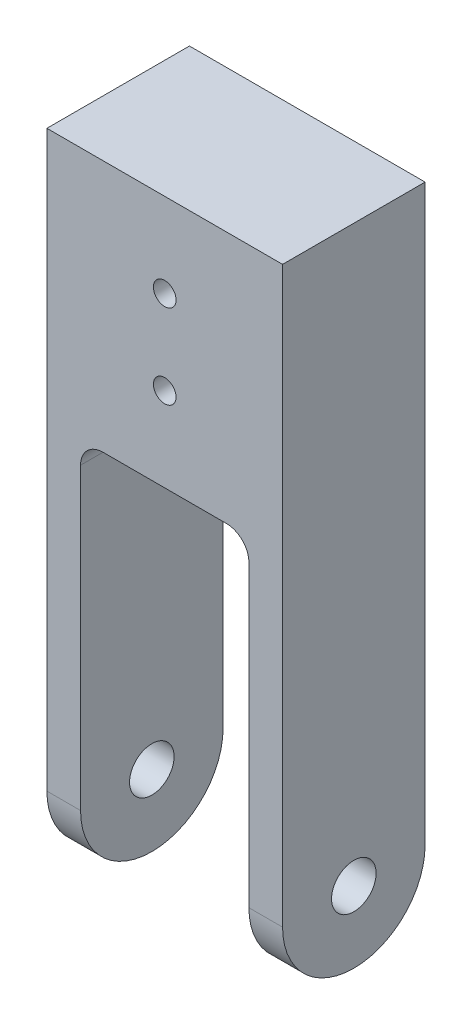
ISO-10303-21;
HEADER;
FILE_DESCRIPTION(('STEP AP214'),'2;1');
FILE_NAME('part.step','',(''),(''),'','','');
FILE_SCHEMA(('AUTOMOTIVE_DESIGN { 1 0 10303 214 1 1 1 1 }'));
ENDSEC;
DATA;
#1=APPLICATION_CONTEXT('core data for automotive mechanical design processes');
#2=APPLICATION_PROTOCOL_DEFINITION('international standard','automotive_design',2000,#1);
#3=PRODUCT_CONTEXT('',#1,'mechanical');
#4=PRODUCT('Part','Part','',(#3));
#5=PRODUCT_RELATED_PRODUCT_CATEGORY('part','',(#4));
#6=PRODUCT_DEFINITION_FORMATION('','',#4);
#7=PRODUCT_DEFINITION_CONTEXT('part definition',#1,'design');
#8=PRODUCT_DEFINITION('design','',#6,#7);
#9=PRODUCT_DEFINITION_SHAPE('','',#8);
#10=(LENGTH_UNIT() NAMED_UNIT(*) SI_UNIT(.MILLI.,.METRE.));
#11=(NAMED_UNIT(*) PLANE_ANGLE_UNIT() SI_UNIT($,.RADIAN.));
#12=(NAMED_UNIT(*) SI_UNIT($,.STERADIAN.) SOLID_ANGLE_UNIT());
#13=UNCERTAINTY_MEASURE_WITH_UNIT(LENGTH_MEASURE(1.E-05),#10,'distance_accuracy_value','');
#14=(GEOMETRIC_REPRESENTATION_CONTEXT(3) GLOBAL_UNCERTAINTY_ASSIGNED_CONTEXT((#13)) GLOBAL_UNIT_ASSIGNED_CONTEXT((#10,
#11,#12)) REPRESENTATION_CONTEXT('',''));
#15=CARTESIAN_POINT('',(0.,0.,0.));
#16=DIRECTION('',(0.,0.,1.));
#17=DIRECTION('',(1.,0.,0.));
#18=AXIS2_PLACEMENT_3D('',#15,#16,#17);
#19=CARTESIAN_POINT('',(21.,0.,-12.7));
#20=DIRECTION('',(0.,-1.,0.));
#21=DIRECTION('',(0.,0.,-1.));
#22=AXIS2_PLACEMENT_3D('',#19,#20,#21);
#23=PLANE('',#22);
#24=DIRECTION('',(-1.,0.,0.));
#25=VECTOR('',#24,1.);
#26=CARTESIAN_POINT('',(-21.,0.,-12.7));
#27=LINE('',#26,#25);
#28=CARTESIAN_POINT('',(11.,0.,-12.7));
#29=VERTEX_POINT('',#28);
#30=CARTESIAN_POINT('',(-11.,0.,-12.7));
#31=VERTEX_POINT('',#30);
#32=EDGE_CURVE('E177',#29,#31,#27,.T.);
#33=ORIENTED_EDGE('',*,*,#32,.F.);
#34=DIRECTION('',(0.,0.,-1.));
#35=VECTOR('',#34,1.);
#36=CARTESIAN_POINT('',(11.,0.,-12.7));
#37=LINE('',#36,#35);
#38=CARTESIAN_POINT('',(11.,0.,12.7));
#39=VERTEX_POINT('',#38);
#40=EDGE_CURVE('E237',#29,#39,#37,.F.);
#41=ORIENTED_EDGE('',*,*,#40,.T.);
#42=DIRECTION('',(1.,0.,0.));
#43=VECTOR('',#42,1.);
#44=CARTESIAN_POINT('',(-21.,0.,12.7));
#45=LINE('',#44,#43);
#46=CARTESIAN_POINT('',(-11.,0.,12.7));
#47=VERTEX_POINT('',#46);
#48=EDGE_CURVE('E232',#47,#39,#45,.T.);
#49=ORIENTED_EDGE('',*,*,#48,.F.);
#50=DIRECTION('',(0.,0.,1.));
#51=VECTOR('',#50,1.);
#52=CARTESIAN_POINT('',(-11.,0.,-12.7));
#53=LINE('',#52,#51);
#54=EDGE_CURVE('E235',#47,#31,#53,.F.);
#55=ORIENTED_EDGE('',*,*,#54,.T.);
#56=EDGE_LOOP('',(#33,#41,#49,#55));
#57=FACE_BOUND('',#56,.T.);
#58=ADVANCED_FACE('F36',(#57),#23,.T.);
#59=CARTESIAN_POINT('',(21.,70.,12.7));
#60=DIRECTION('',(-1.,0.,0.));
#61=DIRECTION('',(0.,0.,1.));
#62=AXIS2_PLACEMENT_3D('',#59,#60,#61);
#63=PLANE('',#62);
#64=CARTESIAN_POINT('',(21.,-57.3,0.));
#65=DIRECTION('',(-1.,0.,0.));
#66=DIRECTION('',(0.,0.,1.));
#67=AXIS2_PLACEMENT_3D('',#64,#65,#66);
#68=CIRCLE('',#67,3.96875);
#69=CARTESIAN_POINT('',(21.,-57.3,3.96875));
#70=VERTEX_POINT('',#69);
#71=EDGE_CURVE('E213',#70,#70,#68,.T.);
#72=ORIENTED_EDGE('',*,*,#71,.T.);
#73=EDGE_LOOP('',(#72));
#74=FACE_BOUND('',#73,.T.);
#75=DIRECTION('',(0.,-1.,0.));
#76=VECTOR('',#75,1.);
#77=CARTESIAN_POINT('',(21.,70.,-12.7));
#78=LINE('',#77,#76);
#79=CARTESIAN_POINT('',(21.,44.9999999999998,-12.7));
#80=VERTEX_POINT('',#79);
#81=CARTESIAN_POINT('',(21.,-57.3,-12.7));
#82=VERTEX_POINT('',#81);
#83=EDGE_CURVE('E145',#80,#82,#78,.T.);
#84=ORIENTED_EDGE('',*,*,#83,.F.);
#85=DIRECTION('',(0.,0.,1.));
#86=VECTOR('',#85,1.);
#87=CARTESIAN_POINT('',(21.,44.9999999999998,-12.7));
#88=LINE('',#87,#86);
#89=CARTESIAN_POINT('',(21.,44.9999999999998,12.7));
#90=VERTEX_POINT('',#89);
#91=EDGE_CURVE('E126',#80,#90,#88,.T.);
#92=ORIENTED_EDGE('',*,*,#91,.T.);
#93=DIRECTION('',(0.,-1.,0.));
#94=VECTOR('',#93,1.);
#95=CARTESIAN_POINT('',(21.,70.,12.7));
#96=LINE('',#95,#94);
#97=CARTESIAN_POINT('',(21.,-57.3,12.7));
#98=VERTEX_POINT('',#97);
#99=EDGE_CURVE('E149',#90,#98,#96,.T.);
#100=ORIENTED_EDGE('',*,*,#99,.T.);
#101=CARTESIAN_POINT('',(21.,-57.3,0.));
#102=DIRECTION('',(-1.,0.,0.));
#103=DIRECTION('',(0.,0.,1.));
#104=AXIS2_PLACEMENT_3D('',#101,#102,#103);
#105=CIRCLE('',#104,12.7);
#106=CARTESIAN_POINT('',(21.,-70.,0.));
#107=VERTEX_POINT('',#106);
#108=EDGE_CURVE('E174',#98,#107,#105,.F.);
#109=ORIENTED_EDGE('',*,*,#108,.T.);
#110=CARTESIAN_POINT('',(21.,-57.3,0.));
#111=DIRECTION('',(-1.,0.,0.));
#112=DIRECTION('',(0.,0.,1.));
#113=AXIS2_PLACEMENT_3D('',#110,#111,#112);
#114=CIRCLE('',#113,12.7);
#115=EDGE_CURVE('E171',#107,#82,#114,.F.);
#116=ORIENTED_EDGE('',*,*,#115,.T.);
#117=EDGE_LOOP('',(#84,#92,#100,#109,#116));
#118=FACE_BOUND('',#117,.T.);
#119=ADVANCED_FACE('F265',(#74,#118),#63,.F.);
#120=CARTESIAN_POINT('',(-21.,70.,-12.7));
#121=DIRECTION('',(0.,0.,1.));
#122=DIRECTION('',(1.,0.,0.));
#123=AXIS2_PLACEMENT_3D('',#120,#121,#122);
#124=PLANE('',#123);
#125=CARTESIAN_POINT('',(0.,30.,-12.7));
#126=DIRECTION('',(0.,0.,1.));
#127=DIRECTION('',(1.,0.,0.));
#128=AXIS2_PLACEMENT_3D('',#125,#126,#127);
#129=CIRCLE('',#128,2.01929999999999);
#130=CARTESIAN_POINT('',(2.0193,30.,-12.7));
#131=VERTEX_POINT('',#130);
#132=EDGE_CURVE('E193',#131,#131,#129,.T.);
#133=ORIENTED_EDGE('',*,*,#132,.T.);
#134=EDGE_LOOP('',(#133));
#135=FACE_BOUND('',#134,.T.);
#136=CARTESIAN_POINT('',(0.,15.,-12.7));
#137=DIRECTION('',(0.,0.,1.));
#138=DIRECTION('',(1.,0.,0.));
#139=AXIS2_PLACEMENT_3D('',#136,#137,#138);
#140=CIRCLE('',#139,2.01929999999999);
#141=CARTESIAN_POINT('',(2.0193,15.,-12.7));
#142=VERTEX_POINT('',#141);
#143=EDGE_CURVE('E209',#142,#142,#140,.T.);
#144=ORIENTED_EDGE('',*,*,#143,.T.);
#145=EDGE_LOOP('',(#144));
#146=FACE_BOUND('',#145,.T.);
#147=DIRECTION('',(0.,-1.,0.));
#148=VECTOR('',#147,1.);
#149=CARTESIAN_POINT('',(-21.,70.,-12.7));
#150=LINE('',#149,#148);
#151=CARTESIAN_POINT('',(-21.,44.9999999999998,-12.7));
#152=VERTEX_POINT('',#151);
#153=CARTESIAN_POINT('',(-21.,-57.3,-12.7));
#154=VERTEX_POINT('',#153);
#155=EDGE_CURVE('E135',#152,#154,#150,.T.);
#156=ORIENTED_EDGE('',*,*,#155,.F.);
#157=DIRECTION('',(1.,0.,0.));
#158=VECTOR('',#157,1.);
#159=CARTESIAN_POINT('',(-21.,44.9999999999998,-12.7));
#160=LINE('',#159,#158);
#161=EDGE_CURVE('E123',#152,#80,#160,.T.);
#162=ORIENTED_EDGE('',*,*,#161,.T.);
#163=ORIENTED_EDGE('',*,*,#83,.T.);
#164=DIRECTION('',(1.,0.,0.));
#165=VECTOR('',#164,1.);
#166=CARTESIAN_POINT('',(-21.,-57.3,-12.7));
#167=LINE('',#166,#165);
#168=CARTESIAN_POINT('',(15.,-57.3,-12.7));
#169=VERTEX_POINT('',#168);
#170=EDGE_CURVE('E179',#82,#169,#167,.F.);
#171=ORIENTED_EDGE('',*,*,#170,.T.);
#172=DIRECTION('',(0.,1.,0.));
#173=VECTOR('',#172,1.);
#174=CARTESIAN_POINT('',(15.,-70.,-12.7));
#175=LINE('',#174,#173);
#176=CARTESIAN_POINT('',(15.,-4.,-12.7));
#177=VERTEX_POINT('',#176);
#178=EDGE_CURVE('E222',#169,#177,#175,.T.);
#179=ORIENTED_EDGE('',*,*,#178,.T.);
#180=CARTESIAN_POINT('',(11.,-4.,-12.7));
#181=DIRECTION('',(0.,0.,1.));
#182=DIRECTION('',(1.,0.,0.));
#183=AXIS2_PLACEMENT_3D('',#180,#181,#182);
#184=CIRCLE('',#183,4.);
#185=EDGE_CURVE('E242',#177,#29,#184,.T.);
#186=ORIENTED_EDGE('',*,*,#185,.T.);
#187=ORIENTED_EDGE('',*,*,#32,.T.);
#188=CARTESIAN_POINT('',(-11.,-4.,-12.7));
#189=DIRECTION('',(0.,0.,1.));
#190=DIRECTION('',(1.,0.,0.));
#191=AXIS2_PLACEMENT_3D('',#188,#189,#190);
#192=CIRCLE('',#191,4.);
#193=CARTESIAN_POINT('',(-15.,-4.,-12.7));
#194=VERTEX_POINT('',#193);
#195=EDGE_CURVE('E249',#31,#194,#192,.T.);
#196=ORIENTED_EDGE('',*,*,#195,.T.);
#197=DIRECTION('',(0.,1.,0.));
#198=VECTOR('',#197,1.);
#199=CARTESIAN_POINT('',(-15.,-70.,-12.7));
#200=LINE('',#199,#198);
#201=CARTESIAN_POINT('',(-15.,-57.3,-12.7));
#202=VERTEX_POINT('',#201);
#203=EDGE_CURVE('E161',#202,#194,#200,.T.);
#204=ORIENTED_EDGE('',*,*,#203,.F.);
#205=DIRECTION('',(1.,0.,0.));
#206=VECTOR('',#205,1.);
#207=CARTESIAN_POINT('',(-21.,-57.3,-12.7));
#208=LINE('',#207,#206);
#209=EDGE_CURVE('E143',#202,#154,#208,.F.);
#210=ORIENTED_EDGE('',*,*,#209,.T.);
#211=EDGE_LOOP('',(#156,#162,#163,#171,#179,#186,#187,#196,#204,#210));
#212=FACE_BOUND('',#211,.T.);
#213=ADVANCED_FACE('F140',(#135,#146,#212),#124,.F.);
#214=CARTESIAN_POINT('',(-21.,70.,12.7));
#215=DIRECTION('',(1.,0.,0.));
#216=DIRECTION('',(0.,0.,-1.));
#217=AXIS2_PLACEMENT_3D('',#214,#215,#216);
#218=PLANE('',#217);
#219=CARTESIAN_POINT('',(-21.,-57.3,0.));
#220=DIRECTION('',(-1.,0.,0.));
#221=DIRECTION('',(0.,0.,1.));
#222=AXIS2_PLACEMENT_3D('',#219,#220,#221);
#223=CIRCLE('',#222,3.96875);
#224=CARTESIAN_POINT('',(-21.,-57.3,3.96875));
#225=VERTEX_POINT('',#224);
#226=EDGE_CURVE('E212',#225,#225,#223,.T.);
#227=ORIENTED_EDGE('',*,*,#226,.F.);
#228=EDGE_LOOP('',(#227));
#229=FACE_BOUND('',#228,.T.);
#230=DIRECTION('',(0.,-1.,0.));
#231=VECTOR('',#230,1.);
#232=CARTESIAN_POINT('',(-21.,70.,12.7));
#233=LINE('',#232,#231);
#234=CARTESIAN_POINT('',(-21.,44.9999999999998,12.7));
#235=VERTEX_POINT('',#234);
#236=CARTESIAN_POINT('',(-21.,-57.3,12.7));
#237=VERTEX_POINT('',#236);
#238=EDGE_CURVE('E138',#235,#237,#233,.T.);
#239=ORIENTED_EDGE('',*,*,#238,.F.);
#240=DIRECTION('',(0.,0.,1.));
#241=VECTOR('',#240,1.);
#242=CARTESIAN_POINT('',(-21.,44.9999999999998,-12.7));
#243=LINE('',#242,#241);
#244=EDGE_CURVE('E53',#152,#235,#243,.T.);
#245=ORIENTED_EDGE('',*,*,#244,.F.);
#246=ORIENTED_EDGE('',*,*,#155,.T.);
#247=CARTESIAN_POINT('',(-21.,-57.3,0.));
#248=DIRECTION('',(1.,0.,0.));
#249=DIRECTION('',(0.,0.,-1.));
#250=AXIS2_PLACEMENT_3D('',#247,#248,#249);
#251=CIRCLE('',#250,12.7);
#252=CARTESIAN_POINT('',(-21.,-70.,0.));
#253=VERTEX_POINT('',#252);
#254=EDGE_CURVE('E181',#154,#253,#251,.F.);
#255=ORIENTED_EDGE('',*,*,#254,.T.);
#256=CARTESIAN_POINT('',(-21.,-57.3,0.));
#257=DIRECTION('',(1.,0.,0.));
#258=DIRECTION('',(0.,0.,-1.));
#259=AXIS2_PLACEMENT_3D('',#256,#257,#258);
#260=CIRCLE('',#259,12.7);
#261=EDGE_CURVE('E183',#253,#237,#260,.F.);
#262=ORIENTED_EDGE('',*,*,#261,.T.);
#263=EDGE_LOOP('',(#239,#245,#246,#255,#262));
#264=FACE_BOUND('',#263,.T.);
#265=ADVANCED_FACE('F134',(#229,#264),#218,.F.);
#266=CARTESIAN_POINT('',(-21.,70.,12.7));
#267=DIRECTION('',(0.,0.,-1.));
#268=DIRECTION('',(-1.,0.,0.));
#269=AXIS2_PLACEMENT_3D('',#266,#267,#268);
#270=PLANE('',#269);
#271=CARTESIAN_POINT('',(0.,30.,12.7));
#272=DIRECTION('',(0.,0.,1.));
#273=DIRECTION('',(1.,0.,0.));
#274=AXIS2_PLACEMENT_3D('',#271,#272,#273);
#275=CIRCLE('',#274,2.01929999999999);
#276=CARTESIAN_POINT('',(2.01929999999999,30.,12.7));
#277=VERTEX_POINT('',#276);
#278=EDGE_CURVE('E187',#277,#277,#275,.T.);
#279=ORIENTED_EDGE('',*,*,#278,.F.);
#280=EDGE_LOOP('',(#279));
#281=FACE_BOUND('',#280,.T.);
#282=CARTESIAN_POINT('',(0.,15.,12.7));
#283=DIRECTION('',(0.,0.,1.));
#284=DIRECTION('',(1.,0.,0.));
#285=AXIS2_PLACEMENT_3D('',#282,#283,#284);
#286=CIRCLE('',#285,2.01929999999999);
#287=CARTESIAN_POINT('',(2.01929999999999,15.,12.7));
#288=VERTEX_POINT('',#287);
#289=EDGE_CURVE('E206',#288,#288,#286,.T.);
#290=ORIENTED_EDGE('',*,*,#289,.F.);
#291=EDGE_LOOP('',(#290));
#292=FACE_BOUND('',#291,.T.);
#293=ORIENTED_EDGE('',*,*,#99,.F.);
#294=DIRECTION('',(1.,0.,0.));
#295=VECTOR('',#294,1.);
#296=CARTESIAN_POINT('',(-21.,44.9999999999998,12.7));
#297=LINE('',#296,#295);
#298=EDGE_CURVE('E130',#235,#90,#297,.T.);
#299=ORIENTED_EDGE('',*,*,#298,.F.);
#300=ORIENTED_EDGE('',*,*,#238,.T.);
#301=DIRECTION('',(-1.,0.,0.));
#302=VECTOR('',#301,1.);
#303=CARTESIAN_POINT('',(-15.,-57.3,12.7));
#304=LINE('',#303,#302);
#305=CARTESIAN_POINT('',(-15.,-57.3,12.7));
#306=VERTEX_POINT('',#305);
#307=EDGE_CURVE('E165',#237,#306,#304,.F.);
#308=ORIENTED_EDGE('',*,*,#307,.T.);
#309=DIRECTION('',(0.,1.,0.));
#310=VECTOR('',#309,1.);
#311=CARTESIAN_POINT('',(-15.,-70.,12.7));
#312=LINE('',#311,#310);
#313=CARTESIAN_POINT('',(-15.,-4.,12.7));
#314=VERTEX_POINT('',#313);
#315=EDGE_CURVE('E158',#306,#314,#312,.T.);
#316=ORIENTED_EDGE('',*,*,#315,.T.);
#317=CARTESIAN_POINT('',(-11.,-4.,12.7));
#318=DIRECTION('',(0.,0.,-1.));
#319=DIRECTION('',(-1.,0.,0.));
#320=AXIS2_PLACEMENT_3D('',#317,#318,#319);
#321=CIRCLE('',#320,4.);
#322=EDGE_CURVE('E247',#314,#47,#321,.T.);
#323=ORIENTED_EDGE('',*,*,#322,.T.);
#324=ORIENTED_EDGE('',*,*,#48,.T.);
#325=CARTESIAN_POINT('',(11.,-4.,12.7));
#326=DIRECTION('',(0.,0.,-1.));
#327=DIRECTION('',(-1.,0.,0.));
#328=AXIS2_PLACEMENT_3D('',#325,#326,#327);
#329=CIRCLE('',#328,4.);
#330=CARTESIAN_POINT('',(15.,-4.,12.7));
#331=VERTEX_POINT('',#330);
#332=EDGE_CURVE('E244',#39,#331,#329,.T.);
#333=ORIENTED_EDGE('',*,*,#332,.T.);
#334=DIRECTION('',(0.,1.,0.));
#335=VECTOR('',#334,1.);
#336=CARTESIAN_POINT('',(15.,-70.,12.7));
#337=LINE('',#336,#335);
#338=CARTESIAN_POINT('',(15.,-57.3,12.7));
#339=VERTEX_POINT('',#338);
#340=EDGE_CURVE('E162',#339,#331,#337,.T.);
#341=ORIENTED_EDGE('',*,*,#340,.F.);
#342=DIRECTION('',(-1.,0.,0.));
#343=VECTOR('',#342,1.);
#344=CARTESIAN_POINT('',(-21.,-57.3,12.7));
#345=LINE('',#344,#343);
#346=EDGE_CURVE('E168',#339,#98,#345,.F.);
#347=ORIENTED_EDGE('',*,*,#346,.T.);
#348=EDGE_LOOP('',(#293,#299,#300,#308,#316,#323,#324,#333,#341,#347));
#349=FACE_BOUND('',#348,.T.);
#350=ADVANCED_FACE('F260',(#281,#292,#349),#270,.F.);
#351=CARTESIAN_POINT('',(-15.,-70.,12.7));
#352=DIRECTION('',(-1.,0.,0.));
#353=DIRECTION('',(0.,0.,1.));
#354=AXIS2_PLACEMENT_3D('',#351,#352,#353);
#355=PLANE('',#354);
#356=CARTESIAN_POINT('',(-15.,-57.3,0.));
#357=DIRECTION('',(-1.,0.,0.));
#358=DIRECTION('',(0.,0.,1.));
#359=AXIS2_PLACEMENT_3D('',#356,#357,#358);
#360=CIRCLE('',#359,3.96875);
#361=CARTESIAN_POINT('',(-15.,-57.3,3.96875));
#362=VERTEX_POINT('',#361);
#363=EDGE_CURVE('E219',#362,#362,#360,.T.);
#364=ORIENTED_EDGE('',*,*,#363,.T.);
#365=EDGE_LOOP('',(#364));
#366=FACE_BOUND('',#365,.T.);
#367=ORIENTED_EDGE('',*,*,#315,.F.);
#368=CARTESIAN_POINT('',(-15.,-57.3,0.));
#369=DIRECTION('',(-1.,0.,0.));
#370=DIRECTION('',(0.,0.,1.));
#371=AXIS2_PLACEMENT_3D('',#368,#369,#370);
#372=CIRCLE('',#371,12.7);
#373=CARTESIAN_POINT('',(-15.,-70.,0.));
#374=VERTEX_POINT('',#373);
#375=EDGE_CURVE('E11',#306,#374,#372,.F.);
#376=ORIENTED_EDGE('',*,*,#375,.T.);
#377=CARTESIAN_POINT('',(-15.,-57.3,0.));
#378=DIRECTION('',(-1.,0.,0.));
#379=DIRECTION('',(0.,0.,1.));
#380=AXIS2_PLACEMENT_3D('',#377,#378,#379);
#381=CIRCLE('',#380,12.7);
#382=EDGE_CURVE('E45',#374,#202,#381,.F.);
#383=ORIENTED_EDGE('',*,*,#382,.T.);
#384=ORIENTED_EDGE('',*,*,#203,.T.);
#385=DIRECTION('',(0.,0.,1.));
#386=VECTOR('',#385,1.);
#387=CARTESIAN_POINT('',(-15.,-4.,12.7));
#388=LINE('',#387,#386);
#389=EDGE_CURVE('E239',#194,#314,#388,.T.);
#390=ORIENTED_EDGE('',*,*,#389,.T.);
#391=EDGE_LOOP('',(#367,#376,#383,#384,#390));
#392=FACE_BOUND('',#391,.T.);
#393=ADVANCED_FACE('F285',(#366,#392),#355,.F.);
#394=CARTESIAN_POINT('',(15.,-70.,12.7));
#395=DIRECTION('',(1.,0.,0.));
#396=DIRECTION('',(0.,0.,-1.));
#397=AXIS2_PLACEMENT_3D('',#394,#395,#396);
#398=PLANE('',#397);
#399=CARTESIAN_POINT('',(15.,-57.3,0.));
#400=DIRECTION('',(1.,0.,0.));
#401=DIRECTION('',(0.,0.,-1.));
#402=AXIS2_PLACEMENT_3D('',#399,#400,#401);
#403=CIRCLE('',#402,3.96875);
#404=CARTESIAN_POINT('',(15.,-57.3,3.96875));
#405=VERTEX_POINT('',#404);
#406=EDGE_CURVE('E216',#405,#405,#403,.T.);
#407=ORIENTED_EDGE('',*,*,#406,.T.);
#408=EDGE_LOOP('',(#407));
#409=FACE_BOUND('',#408,.T.);
#410=CARTESIAN_POINT('',(15.,-57.3,0.));
#411=DIRECTION('',(1.,0.,0.));
#412=DIRECTION('',(0.,0.,-1.));
#413=AXIS2_PLACEMENT_3D('',#410,#411,#412);
#414=CIRCLE('',#413,12.7);
#415=CARTESIAN_POINT('',(15.,-70.,0.));
#416=VERTEX_POINT('',#415);
#417=EDGE_CURVE('E251',#169,#416,#414,.F.);
#418=ORIENTED_EDGE('',*,*,#417,.T.);
#419=CARTESIAN_POINT('',(15.,-57.3,0.));
#420=DIRECTION('',(1.,0.,0.));
#421=DIRECTION('',(0.,0.,-1.));
#422=AXIS2_PLACEMENT_3D('',#419,#420,#421);
#423=CIRCLE('',#422,12.7);
#424=EDGE_CURVE('E163',#416,#339,#423,.F.);
#425=ORIENTED_EDGE('',*,*,#424,.T.);
#426=ORIENTED_EDGE('',*,*,#340,.T.);
#427=DIRECTION('',(0.,0.,-1.));
#428=VECTOR('',#427,1.);
#429=CARTESIAN_POINT('',(15.,-4.,12.7));
#430=LINE('',#429,#428);
#431=EDGE_CURVE('E147',#331,#177,#430,.T.);
#432=ORIENTED_EDGE('',*,*,#431,.T.);
#433=ORIENTED_EDGE('',*,*,#178,.F.);
#434=EDGE_LOOP('',(#418,#425,#426,#432,#433));
#435=FACE_BOUND('',#434,.T.);
#436=ADVANCED_FACE('F256',(#409,#435),#398,.F.);
#437=CARTESIAN_POINT('',(21.,-57.3,0.));
#438=DIRECTION('',(-1.,0.,0.));
#439=DIRECTION('',(0.,0.,1.));
#440=AXIS2_PLACEMENT_3D('',#437,#438,#439);
#441=CYLINDRICAL_SURFACE('',#440,3.96875);
#442=CARTESIAN_POINT('',(21.,-57.3,3.96875));
#443=CARTESIAN_POINT('',(20.9375,-57.3,3.96875));
#444=CARTESIAN_POINT('',(20.875,-57.3,3.96875));
#445=CARTESIAN_POINT('',(20.75,-57.3,3.96875));
#446=CARTESIAN_POINT('',(20.6875,-57.3,3.96875));
#447=CARTESIAN_POINT('',(20.5625,-57.3,3.96875));
#448=CARTESIAN_POINT('',(20.5,-57.3,3.96875));
#449=CARTESIAN_POINT('',(20.375,-57.3,3.96875));
#450=CARTESIAN_POINT('',(20.3125,-57.3,3.96875));
#451=CARTESIAN_POINT('',(20.1875,-57.3,3.96875));
#452=CARTESIAN_POINT('',(20.125,-57.3,3.96875));
#453=CARTESIAN_POINT('',(20.,-57.3,3.96875));
#454=CARTESIAN_POINT('',(19.9375,-57.3,3.96875));
#455=CARTESIAN_POINT('',(19.8125,-57.3,3.96875));
#456=CARTESIAN_POINT('',(19.75,-57.3,3.96875));
#457=CARTESIAN_POINT('',(19.625,-57.3,3.96875));
#458=CARTESIAN_POINT('',(19.5625,-57.3,3.96875));
#459=CARTESIAN_POINT('',(19.4375,-57.3,3.96875));
#460=CARTESIAN_POINT('',(19.375,-57.3,3.96875));
#461=CARTESIAN_POINT('',(19.25,-57.3,3.96875));
#462=CARTESIAN_POINT('',(19.1875,-57.3,3.96875));
#463=CARTESIAN_POINT('',(19.0625,-57.3,3.96875));
#464=CARTESIAN_POINT('',(19.,-57.3,3.96875));
#465=CARTESIAN_POINT('',(18.875,-57.3,3.96875));
#466=CARTESIAN_POINT('',(18.8125,-57.3,3.96875));
#467=CARTESIAN_POINT('',(18.6875,-57.3,3.96875));
#468=CARTESIAN_POINT('',(18.625,-57.3,3.96875));
#469=CARTESIAN_POINT('',(18.5,-57.3,3.96875));
#470=CARTESIAN_POINT('',(18.4375,-57.3,3.96875));
#471=CARTESIAN_POINT('',(18.3125,-57.3,3.96875));
#472=CARTESIAN_POINT('',(18.25,-57.3,3.96875));
#473=CARTESIAN_POINT('',(18.125,-57.3,3.96875));
#474=CARTESIAN_POINT('',(18.0625,-57.3,3.96875));
#475=CARTESIAN_POINT('',(17.9375,-57.3,3.96875));
#476=CARTESIAN_POINT('',(17.875,-57.3,3.96875));
#477=CARTESIAN_POINT('',(17.75,-57.3,3.96875));
#478=CARTESIAN_POINT('',(17.6875,-57.3,3.96875));
#479=CARTESIAN_POINT('',(17.5625,-57.3,3.96875));
#480=CARTESIAN_POINT('',(17.5,-57.3,3.96875));
#481=CARTESIAN_POINT('',(17.375,-57.3,3.96875));
#482=CARTESIAN_POINT('',(17.3125,-57.3,3.96875));
#483=CARTESIAN_POINT('',(17.1875,-57.3,3.96875));
#484=CARTESIAN_POINT('',(17.125,-57.3,3.96875));
#485=CARTESIAN_POINT('',(17.,-57.3,3.96875));
#486=CARTESIAN_POINT('',(16.9375,-57.3,3.96875));
#487=CARTESIAN_POINT('',(16.8125,-57.3,3.96875));
#488=CARTESIAN_POINT('',(16.75,-57.3,3.96875));
#489=CARTESIAN_POINT('',(16.625,-57.3,3.96875));
#490=CARTESIAN_POINT('',(16.5625,-57.3,3.96875));
#491=CARTESIAN_POINT('',(16.4375,-57.3,3.96875));
#492=CARTESIAN_POINT('',(16.375,-57.3,3.96875));
#493=CARTESIAN_POINT('',(16.25,-57.3,3.96875));
#494=CARTESIAN_POINT('',(16.1875,-57.3,3.96875));
#495=CARTESIAN_POINT('',(16.0625,-57.3,3.96875));
#496=CARTESIAN_POINT('',(16.,-57.3,3.96875));
#497=CARTESIAN_POINT('',(15.875,-57.3,3.96875));
#498=CARTESIAN_POINT('',(15.8125,-57.3,3.96875));
#499=CARTESIAN_POINT('',(15.6875,-57.3,3.96875));
#500=CARTESIAN_POINT('',(15.625,-57.3,3.96875));
#501=CARTESIAN_POINT('',(15.5,-57.3,3.96875));
#502=CARTESIAN_POINT('',(15.4375,-57.3,3.96875));
#503=CARTESIAN_POINT('',(15.3125,-57.3,3.96875));
#504=CARTESIAN_POINT('',(15.25,-57.3,3.96875));
#505=CARTESIAN_POINT('',(15.125,-57.3,3.96875));
#506=CARTESIAN_POINT('',(15.0625,-57.3,3.96875));
#507=CARTESIAN_POINT('',(15.,-57.3,3.96875));
#508=B_SPLINE_CURVE_WITH_KNOTS('',3,(#442,#443,#444,#445,#446,#447,#448,#449,#450,#451,#452,
#453,#454,#455,#456,#457,#458,#459,#460,#461,#462,#463,#464,#465,#466,#467,#468,#469,#470,#471,
#472,#473,#474,#475,#476,#477,#478,#479,#480,#481,#482,#483,#484,#485,#486,#487,#488,#489,#490,
#491,#492,#493,#494,#495,#496,#497,#498,#499,#500,#501,#502,#503,#504,#505,#506,#507),
.UNSPECIFIED.,.F.,.F.,(4,2,2,2,2,2,2,2,2,2,2,2,2,2,2,2,2,2,2,2,2,2,2,2,2,2,2,2,2,2,2,2,4),(0.,
0.1875,0.375,0.5625,0.750000000000001,0.937500000000001,1.125,1.3125,1.5,1.6875,1.875,2.0625,
2.25,2.4375,2.625,2.8125,3.,3.1875,3.375,3.5625,3.75,3.9375,4.125,4.3125,4.5,4.6875,4.875,
5.0625,5.25,5.4375,5.62500000000001,5.81250000000001,6.00000000000001),.UNSPECIFIED.);
#509=EDGE_CURVE('BSEAM293',#70,#405,#508,.T.);
#510=ORIENTED_EDGE('',*,*,#71,.F.);
#511=ORIENTED_EDGE('',*,*,#406,.F.);
#512=ORIENTED_EDGE('',*,*,#509,.T.);
#513=ORIENTED_EDGE('',*,*,#509,.F.);
#514=EDGE_LOOP('',(#510,#512,#511,#513));
#515=FACE_BOUND('',#514,.T.);
#516=ADVANCED_FACE('F293',(#515),#441,.F.);
#517=CARTESIAN_POINT('',(-21.,-57.3,3.96875));
#518=CARTESIAN_POINT('',(-20.9375,-57.3,3.96875));
#519=CARTESIAN_POINT('',(-20.875,-57.3,3.96875));
#520=CARTESIAN_POINT('',(-20.75,-57.3,3.96875));
#521=CARTESIAN_POINT('',(-20.6875,-57.3,3.96875));
#522=CARTESIAN_POINT('',(-20.5625,-57.3,3.96875));
#523=CARTESIAN_POINT('',(-20.5,-57.3,3.96875));
#524=CARTESIAN_POINT('',(-20.375,-57.3,3.96875));
#525=CARTESIAN_POINT('',(-20.3125,-57.3,3.96875));
#526=CARTESIAN_POINT('',(-20.1875,-57.3,3.96875));
#527=CARTESIAN_POINT('',(-20.125,-57.3,3.96875));
#528=CARTESIAN_POINT('',(-20.,-57.3,3.96875));
#529=CARTESIAN_POINT('',(-19.9375,-57.3,3.96875));
#530=CARTESIAN_POINT('',(-19.8125,-57.3,3.96875));
#531=CARTESIAN_POINT('',(-19.75,-57.3,3.96875));
#532=CARTESIAN_POINT('',(-19.625,-57.3,3.96875));
#533=CARTESIAN_POINT('',(-19.5625,-57.3,3.96875));
#534=CARTESIAN_POINT('',(-19.4375,-57.3,3.96875));
#535=CARTESIAN_POINT('',(-19.375,-57.3,3.96875));
#536=CARTESIAN_POINT('',(-19.25,-57.3,3.96875));
#537=CARTESIAN_POINT('',(-19.1875,-57.3,3.96875));
#538=CARTESIAN_POINT('',(-19.0625,-57.3,3.96875));
#539=CARTESIAN_POINT('',(-19.,-57.3,3.96875));
#540=CARTESIAN_POINT('',(-18.875,-57.3,3.96875));
#541=CARTESIAN_POINT('',(-18.8125,-57.3,3.96875));
#542=CARTESIAN_POINT('',(-18.6875,-57.3,3.96875));
#543=CARTESIAN_POINT('',(-18.625,-57.3,3.96875));
#544=CARTESIAN_POINT('',(-18.5,-57.3,3.96875));
#545=CARTESIAN_POINT('',(-18.4375,-57.3,3.96875));
#546=CARTESIAN_POINT('',(-18.3125,-57.3,3.96875));
#547=CARTESIAN_POINT('',(-18.25,-57.3,3.96875));
#548=CARTESIAN_POINT('',(-18.125,-57.3,3.96875));
#549=CARTESIAN_POINT('',(-18.0625,-57.3,3.96875));
#550=CARTESIAN_POINT('',(-17.9375,-57.3,3.96875));
#551=CARTESIAN_POINT('',(-17.875,-57.3,3.96875));
#552=CARTESIAN_POINT('',(-17.75,-57.3,3.96875));
#553=CARTESIAN_POINT('',(-17.6875,-57.3,3.96875));
#554=CARTESIAN_POINT('',(-17.5625,-57.3,3.96875));
#555=CARTESIAN_POINT('',(-17.5,-57.3,3.96875));
#556=CARTESIAN_POINT('',(-17.375,-57.3,3.96875));
#557=CARTESIAN_POINT('',(-17.3125,-57.3,3.96875));
#558=CARTESIAN_POINT('',(-17.1875,-57.3,3.96875));
#559=CARTESIAN_POINT('',(-17.125,-57.3,3.96875));
#560=CARTESIAN_POINT('',(-17.,-57.3,3.96875));
#561=CARTESIAN_POINT('',(-16.9375,-57.3,3.96875));
#562=CARTESIAN_POINT('',(-16.8125,-57.3,3.96875));
#563=CARTESIAN_POINT('',(-16.75,-57.3,3.96875));
#564=CARTESIAN_POINT('',(-16.625,-57.3,3.96875));
#565=CARTESIAN_POINT('',(-16.5625,-57.3,3.96875));
#566=CARTESIAN_POINT('',(-16.4375,-57.3,3.96875));
#567=CARTESIAN_POINT('',(-16.375,-57.3,3.96875));
#568=CARTESIAN_POINT('',(-16.25,-57.3,3.96875));
#569=CARTESIAN_POINT('',(-16.1875,-57.3,3.96875));
#570=CARTESIAN_POINT('',(-16.0625,-57.3,3.96875));
#571=CARTESIAN_POINT('',(-16.,-57.3,3.96875));
#572=CARTESIAN_POINT('',(-15.875,-57.3,3.96875));
#573=CARTESIAN_POINT('',(-15.8125,-57.3,3.96875));
#574=CARTESIAN_POINT('',(-15.6875,-57.3,3.96875));
#575=CARTESIAN_POINT('',(-15.625,-57.3,3.96875));
#576=CARTESIAN_POINT('',(-15.5,-57.3,3.96875));
#577=CARTESIAN_POINT('',(-15.4375,-57.3,3.96875));
#578=CARTESIAN_POINT('',(-15.3125,-57.3,3.96875));
#579=CARTESIAN_POINT('',(-15.25,-57.3,3.96875));
#580=CARTESIAN_POINT('',(-15.125,-57.3,3.96875));
#581=CARTESIAN_POINT('',(-15.0625,-57.3,3.96875));
#582=CARTESIAN_POINT('',(-15.,-57.3,3.96875));
#583=B_SPLINE_CURVE_WITH_KNOTS('',3,(#517,#518,#519,#520,#521,#522,#523,#524,#525,#526,#527,
#528,#529,#530,#531,#532,#533,#534,#535,#536,#537,#538,#539,#540,#541,#542,#543,#544,#545,#546,
#547,#548,#549,#550,#551,#552,#553,#554,#555,#556,#557,#558,#559,#560,#561,#562,#563,#564,#565,
#566,#567,#568,#569,#570,#571,#572,#573,#574,#575,#576,#577,#578,#579,#580,#581,#582),
.UNSPECIFIED.,.F.,.F.,(4,2,2,2,2,2,2,2,2,2,2,2,2,2,2,2,2,2,2,2,2,2,2,2,2,2,2,2,2,2,2,2,4),(0.,
0.1875,0.375,0.5625,0.750000000000001,0.937500000000001,1.125,1.3125,1.5,1.68749999999999,
1.87499999999999,2.06249999999999,2.25,2.4375,2.625,2.8125,3.,3.1875,3.375,3.5625,3.75,3.9375,
4.125,4.3125,4.49999999999999,4.6875,4.87499999999999,5.06249999999999,5.24999999999999,
5.43749999999999,5.62499999999999,5.81249999999999,5.99999999999999),.UNSPECIFIED.);
#584=EDGE_CURVE('BSEAM314',#225,#362,#583,.T.);
#585=ORIENTED_EDGE('',*,*,#226,.T.);
#586=ORIENTED_EDGE('',*,*,#363,.F.);
#587=ORIENTED_EDGE('',*,*,#584,.T.);
#588=ORIENTED_EDGE('',*,*,#584,.F.);
#589=EDGE_LOOP('',(#585,#587,#586,#588));
#590=FACE_BOUND('',#589,.T.);
#591=ADVANCED_FACE('F314',(#590),#441,.F.);
#592=CARTESIAN_POINT('',(11.,-4.,12.7));
#593=DIRECTION('',(0.,0.,-1.));
#594=DIRECTION('',(-1.,0.,0.));
#595=AXIS2_PLACEMENT_3D('',#592,#593,#594);
#596=CYLINDRICAL_SURFACE('',#595,4.);
#597=ORIENTED_EDGE('',*,*,#332,.F.);
#598=ORIENTED_EDGE('',*,*,#40,.F.);
#599=ORIENTED_EDGE('',*,*,#185,.F.);
#600=ORIENTED_EDGE('',*,*,#431,.F.);
#601=EDGE_LOOP('',(#597,#598,#599,#600));
#602=FACE_BOUND('',#601,.T.);
#603=ADVANCED_FACE('F271',(#602),#596,.F.);
#604=CARTESIAN_POINT('',(-11.,-4.,12.7));
#605=DIRECTION('',(0.,0.,1.));
#606=DIRECTION('',(1.,0.,0.));
#607=AXIS2_PLACEMENT_3D('',#604,#605,#606);
#608=CYLINDRICAL_SURFACE('',#607,4.);
#609=ORIENTED_EDGE('',*,*,#195,.F.);
#610=ORIENTED_EDGE('',*,*,#54,.F.);
#611=ORIENTED_EDGE('',*,*,#322,.F.);
#612=ORIENTED_EDGE('',*,*,#389,.F.);
#613=EDGE_LOOP('',(#609,#610,#611,#612));
#614=FACE_BOUND('',#613,.T.);
#615=ADVANCED_FACE('F280',(#614),#608,.F.);
#616=CARTESIAN_POINT('',(0.,15.,12.7));
#617=DIRECTION('',(0.,0.,1.));
#618=DIRECTION('',(1.,0.,0.));
#619=AXIS2_PLACEMENT_3D('',#616,#617,#618);
#620=CYLINDRICAL_SURFACE('',#619,2.01929999999999);
#621=ORIENTED_EDGE('',*,*,#143,.F.);
#622=EDGE_LOOP('',(#621));
#623=FACE_BOUND('',#622,.T.);
#624=ORIENTED_EDGE('',*,*,#289,.T.);
#625=EDGE_LOOP('',(#624));
#626=FACE_BOUND('',#625,.T.);
#627=ADVANCED_FACE('F317',(#623,#626),#620,.F.);
#628=CARTESIAN_POINT('',(0.,30.,12.7));
#629=DIRECTION('',(0.,0.,1.));
#630=DIRECTION('',(1.,0.,0.));
#631=AXIS2_PLACEMENT_3D('',#628,#629,#630);
#632=CYLINDRICAL_SURFACE('',#631,2.01929999999999);
#633=ORIENTED_EDGE('',*,*,#132,.F.);
#634=EDGE_LOOP('',(#633));
#635=FACE_BOUND('',#634,.T.);
#636=ORIENTED_EDGE('',*,*,#278,.T.);
#637=EDGE_LOOP('',(#636));
#638=FACE_BOUND('',#637,.T.);
#639=ADVANCED_FACE('F321',(#635,#638),#632,.F.);
#640=CARTESIAN_POINT('',(21.,-57.3,0.));
#641=DIRECTION('',(1.,0.,0.));
#642=DIRECTION('',(0.,0.,-1.));
#643=AXIS2_PLACEMENT_3D('',#640,#641,#642);
#644=CYLINDRICAL_SURFACE('',#643,12.7);
#645=ORIENTED_EDGE('',*,*,#170,.F.);
#646=ORIENTED_EDGE('',*,*,#115,.F.);
#647=DIRECTION('',(1.,0.,0.));
#648=VECTOR('',#647,1.);
#649=CARTESIAN_POINT('',(21.,-70.,0.));
#650=LINE('',#649,#648);
#651=EDGE_CURVE('E185',#416,#107,#650,.T.);
#652=ORIENTED_EDGE('',*,*,#651,.F.);
#653=ORIENTED_EDGE('',*,*,#417,.F.);
#654=EDGE_LOOP('',(#645,#646,#652,#653));
#655=FACE_BOUND('',#654,.T.);
#656=ADVANCED_FACE('F268',(#655),#644,.T.);
#657=CARTESIAN_POINT('',(21.,-57.3,0.));
#658=DIRECTION('',(-1.,0.,0.));
#659=DIRECTION('',(0.,0.,1.));
#660=AXIS2_PLACEMENT_3D('',#657,#658,#659);
#661=CYLINDRICAL_SURFACE('',#660,12.7);
#662=ORIENTED_EDGE('',*,*,#108,.F.);
#663=ORIENTED_EDGE('',*,*,#346,.F.);
#664=ORIENTED_EDGE('',*,*,#424,.F.);
#665=ORIENTED_EDGE('',*,*,#651,.T.);
#666=EDGE_LOOP('',(#662,#663,#664,#665));
#667=FACE_BOUND('',#666,.T.);
#668=ADVANCED_FACE('F263',(#667),#661,.T.);
#669=CARTESIAN_POINT('',(-21.,-57.3,0.));
#670=DIRECTION('',(-1.,0.,0.));
#671=DIRECTION('',(0.,0.,1.));
#672=AXIS2_PLACEMENT_3D('',#669,#670,#671);
#673=CYLINDRICAL_SURFACE('',#672,12.7);
#674=ORIENTED_EDGE('',*,*,#209,.F.);
#675=ORIENTED_EDGE('',*,*,#382,.F.);
#676=DIRECTION('',(1.,0.,0.));
#677=VECTOR('',#676,1.);
#678=CARTESIAN_POINT('',(-15.,-70.,0.));
#679=LINE('',#678,#677);
#680=EDGE_CURVE('E40',#253,#374,#679,.T.);
#681=ORIENTED_EDGE('',*,*,#680,.F.);
#682=ORIENTED_EDGE('',*,*,#254,.F.);
#683=EDGE_LOOP('',(#674,#675,#681,#682));
#684=FACE_BOUND('',#683,.T.);
#685=ADVANCED_FACE('F38',(#684),#673,.T.);
#686=CARTESIAN_POINT('',(-21.,-57.3,0.));
#687=DIRECTION('',(1.,0.,0.));
#688=DIRECTION('',(0.,0.,-1.));
#689=AXIS2_PLACEMENT_3D('',#686,#687,#688);
#690=CYLINDRICAL_SURFACE('',#689,12.7);
#691=ORIENTED_EDGE('',*,*,#375,.F.);
#692=ORIENTED_EDGE('',*,*,#307,.F.);
#693=ORIENTED_EDGE('',*,*,#261,.F.);
#694=ORIENTED_EDGE('',*,*,#680,.T.);
#695=EDGE_LOOP('',(#691,#692,#693,#694));
#696=FACE_BOUND('',#695,.T.);
#697=ADVANCED_FACE('F284',(#696),#690,.T.);
#698=CARTESIAN_POINT('',(-21.,44.9999999999998,-12.7));
#699=DIRECTION('',(0.,-1.,0.));
#700=DIRECTION('',(0.,0.,-1.));
#701=AXIS2_PLACEMENT_3D('',#698,#699,#700);
#702=PLANE('',#701);
#703=ORIENTED_EDGE('',*,*,#298,.T.);
#704=ORIENTED_EDGE('',*,*,#91,.F.);
#705=ORIENTED_EDGE('',*,*,#161,.F.);
#706=ORIENTED_EDGE('',*,*,#244,.T.);
#707=EDGE_LOOP('',(#703,#704,#705,#706));
#708=FACE_BOUND('',#707,.T.);
#709=ADVANCED_FACE('F124',(#708),#702,.F.);
#710=CLOSED_SHELL('',(#58,#119,#213,#265,#350,#393,#436,#516,#591,#603,#615,#627,#639,#656,#668,
#685,#697,#709));
#711=MANIFOLD_SOLID_BREP('B2',#710);
#712=ADVANCED_BREP_SHAPE_REPRESENTATION('',(#18,#711),#14);
#713=SHAPE_DEFINITION_REPRESENTATION(#9,#712);
ENDSEC;
END-ISO-10303-21;
